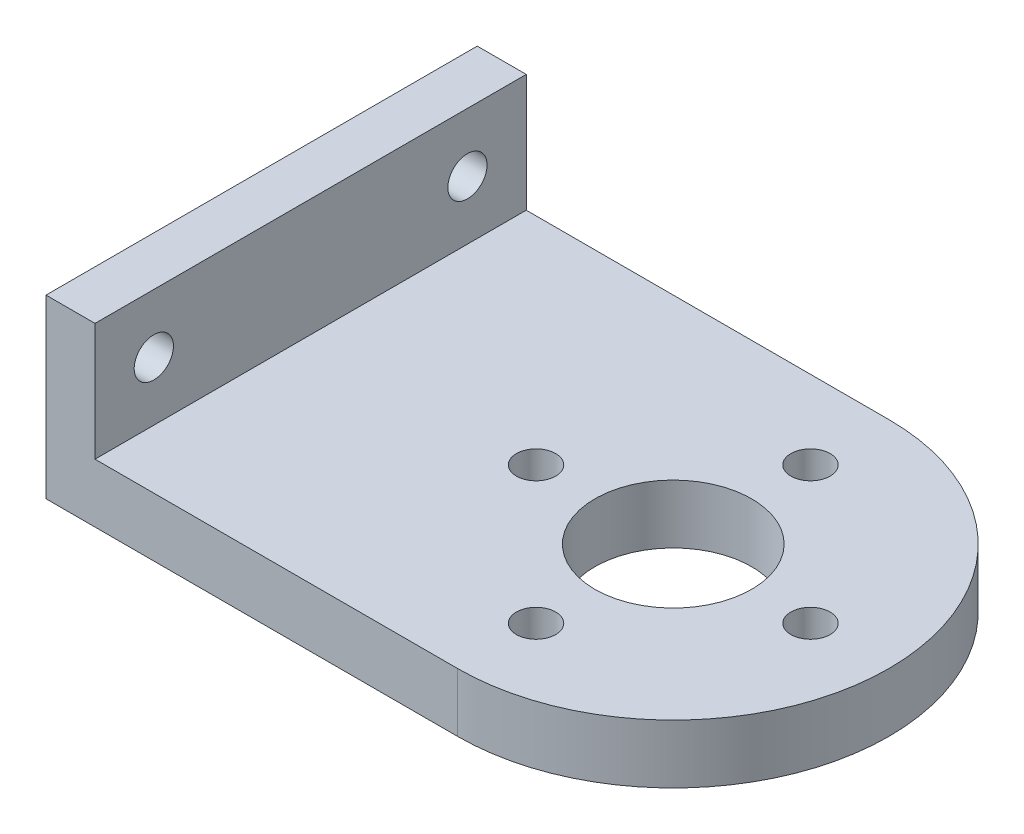
ISO-10303-21;
HEADER;
FILE_DESCRIPTION(('STEP AP214'),'2;1');
FILE_NAME('part.step','',(''),(''),'','','');
FILE_SCHEMA(('AUTOMOTIVE_DESIGN { 1 0 10303 214 1 1 1 1 }'));
ENDSEC;
DATA;
#1=APPLICATION_CONTEXT('core data for automotive mechanical design processes');
#2=APPLICATION_PROTOCOL_DEFINITION('international standard','automotive_design',2000,#1);
#3=PRODUCT_CONTEXT('',#1,'mechanical');
#4=PRODUCT('Part','Part','',(#3));
#5=PRODUCT_RELATED_PRODUCT_CATEGORY('part','',(#4));
#6=PRODUCT_DEFINITION_FORMATION('','',#4);
#7=PRODUCT_DEFINITION_CONTEXT('part definition',#1,'design');
#8=PRODUCT_DEFINITION('design','',#6,#7);
#9=PRODUCT_DEFINITION_SHAPE('','',#8);
#10=(LENGTH_UNIT() NAMED_UNIT(*) SI_UNIT(.MILLI.,.METRE.));
#11=(NAMED_UNIT(*) PLANE_ANGLE_UNIT() SI_UNIT($,.RADIAN.));
#12=(NAMED_UNIT(*) SI_UNIT($,.STERADIAN.) SOLID_ANGLE_UNIT());
#13=UNCERTAINTY_MEASURE_WITH_UNIT(LENGTH_MEASURE(1.E-05),#10,'distance_accuracy_value','');
#14=(GEOMETRIC_REPRESENTATION_CONTEXT(3) GLOBAL_UNCERTAINTY_ASSIGNED_CONTEXT((#13)) GLOBAL_UNIT_ASSIGNED_CONTEXT((#10,
#11,#12)) REPRESENTATION_CONTEXT('',''));
#15=CARTESIAN_POINT('',(0.,0.,0.));
#16=DIRECTION('',(0.,0.,1.));
#17=DIRECTION('',(1.,0.,0.));
#18=AXIS2_PLACEMENT_3D('',#15,#16,#17);
#19=CARTESIAN_POINT('',(-14.,3.,0.));
#20=DIRECTION('',(-1.,0.,0.));
#21=DIRECTION('',(0.,0.,1.));
#22=AXIS2_PLACEMENT_3D('',#19,#20,#21);
#23=PLANE('',#22);
#24=CARTESIAN_POINT('',(-14.,6.,8.));
#25=DIRECTION('',(-1.,0.,0.));
#26=DIRECTION('',(0.,0.,1.));
#27=AXIS2_PLACEMENT_3D('',#24,#25,#26);
#28=CIRCLE('',#27,1.);
#29=CARTESIAN_POINT('',(-14.,6.,9.));
#30=VERTEX_POINT('',#29);
#31=EDGE_CURVE('E172',#30,#30,#28,.T.);
#32=ORIENTED_EDGE('',*,*,#31,.F.);
#33=EDGE_LOOP('',(#32));
#34=FACE_BOUND('',#33,.T.);
#35=CARTESIAN_POINT('',(-14.,6.,-8.));
#36=DIRECTION('',(-1.,0.,0.));
#37=DIRECTION('',(0.,0.,1.));
#38=AXIS2_PLACEMENT_3D('',#35,#36,#37);
#39=CIRCLE('',#38,1.);
#40=CARTESIAN_POINT('',(-14.,6.,-7.));
#41=VERTEX_POINT('',#40);
#42=EDGE_CURVE('E158',#41,#41,#39,.T.);
#43=ORIENTED_EDGE('',*,*,#42,.F.);
#44=EDGE_LOOP('',(#43));
#45=FACE_BOUND('',#44,.T.);
#46=DIRECTION('',(0.,0.,-1.));
#47=VECTOR('',#46,1.);
#48=CARTESIAN_POINT('',(-14.,0.,0.));
#49=LINE('',#48,#47);
#50=CARTESIAN_POINT('',(-14.,0.,11.));
#51=VERTEX_POINT('',#50);
#52=CARTESIAN_POINT('',(-14.,0.,-11.));
#53=VERTEX_POINT('',#52);
#54=EDGE_CURVE('E83',#51,#53,#49,.T.);
#55=ORIENTED_EDGE('',*,*,#54,.F.);
#56=DIRECTION('',(0.,-1.,0.));
#57=VECTOR('',#56,1.);
#58=CARTESIAN_POINT('',(-14.,3.,11.));
#59=LINE('',#58,#57);
#60=CARTESIAN_POINT('',(-14.,9.,11.));
#61=VERTEX_POINT('',#60);
#62=EDGE_CURVE('E11',#61,#51,#59,.T.);
#63=ORIENTED_EDGE('',*,*,#62,.F.);
#64=DIRECTION('',(0.,0.,1.));
#65=VECTOR('',#64,1.);
#66=CARTESIAN_POINT('',(-14.,9.,11.));
#67=LINE('',#66,#65);
#68=CARTESIAN_POINT('',(-14.,9.,-11.));
#69=VERTEX_POINT('',#68);
#70=EDGE_CURVE('E86',#69,#61,#67,.T.);
#71=ORIENTED_EDGE('',*,*,#70,.F.);
#72=DIRECTION('',(0.,-1.,0.));
#73=VECTOR('',#72,1.);
#74=CARTESIAN_POINT('',(-14.,3.,-11.));
#75=LINE('',#74,#73);
#76=EDGE_CURVE('E80',#69,#53,#75,.T.);
#77=ORIENTED_EDGE('',*,*,#76,.T.);
#78=EDGE_LOOP('',(#55,#63,#71,#77));
#79=FACE_BOUND('',#78,.T.);
#80=ADVANCED_FACE('F38',(#34,#45,#79),#23,.T.);
#81=CARTESIAN_POINT('',(0.,3.,11.));
#82=DIRECTION('',(0.,0.,1.));
#83=DIRECTION('',(1.,0.,0.));
#84=AXIS2_PLACEMENT_3D('',#81,#82,#83);
#85=PLANE('',#84);
#86=DIRECTION('',(-1.,0.,0.));
#87=VECTOR('',#86,1.);
#88=CARTESIAN_POINT('',(0.,0.,11.));
#89=LINE('',#88,#87);
#90=CARTESIAN_POINT('',(7.,0.,11.));
#91=VERTEX_POINT('',#90);
#92=EDGE_CURVE('E100',#91,#51,#89,.T.);
#93=ORIENTED_EDGE('',*,*,#92,.F.);
#94=DIRECTION('',(0.,-1.,0.));
#95=VECTOR('',#94,1.);
#96=CARTESIAN_POINT('',(7.,3.,11.));
#97=LINE('',#96,#95);
#98=CARTESIAN_POINT('',(7.,3.,11.));
#99=VERTEX_POINT('',#98);
#100=EDGE_CURVE('E46',#99,#91,#97,.T.);
#101=ORIENTED_EDGE('',*,*,#100,.F.);
#102=DIRECTION('',(-1.,0.,0.));
#103=VECTOR('',#102,1.);
#104=CARTESIAN_POINT('',(0.,3.,11.));
#105=LINE('',#104,#103);
#106=CARTESIAN_POINT('',(-11.5,3.,11.));
#107=VERTEX_POINT('',#106);
#108=EDGE_CURVE('E139',#99,#107,#105,.T.);
#109=ORIENTED_EDGE('',*,*,#108,.T.);
#110=DIRECTION('',(0.,-1.,0.));
#111=VECTOR('',#110,1.);
#112=CARTESIAN_POINT('',(-11.5,9.,11.));
#113=LINE('',#112,#111);
#114=CARTESIAN_POINT('',(-11.5,9.,11.));
#115=VERTEX_POINT('',#114);
#116=EDGE_CURVE('E134',#115,#107,#113,.T.);
#117=ORIENTED_EDGE('',*,*,#116,.F.);
#118=DIRECTION('',(1.,0.,0.));
#119=VECTOR('',#118,1.);
#120=CARTESIAN_POINT('',(-11.5,9.,11.));
#121=LINE('',#120,#119);
#122=EDGE_CURVE('E163',#61,#115,#121,.T.);
#123=ORIENTED_EDGE('',*,*,#122,.F.);
#124=ORIENTED_EDGE('',*,*,#62,.T.);
#125=EDGE_LOOP('',(#93,#101,#109,#117,#123,#124));
#126=FACE_BOUND('',#125,.T.);
#127=ADVANCED_FACE('F120',(#126),#85,.T.);
#128=CARTESIAN_POINT('',(7.,3.,0.));
#129=DIRECTION('',(0.,-1.,0.));
#130=DIRECTION('',(0.,0.,-1.));
#131=AXIS2_PLACEMENT_3D('',#128,#129,#130);
#132=CYLINDRICAL_SURFACE('',#131,11.);
#133=CARTESIAN_POINT('',(7.,0.,0.));
#134=DIRECTION('',(0.,1.,0.));
#135=DIRECTION('',(0.,0.,1.));
#136=AXIS2_PLACEMENT_3D('',#133,#134,#135);
#137=CIRCLE('',#136,11.);
#138=CARTESIAN_POINT('',(7.,0.,-11.));
#139=VERTEX_POINT('',#138);
#140=EDGE_CURVE('E107',#91,#139,#137,.T.);
#141=ORIENTED_EDGE('',*,*,#140,.T.);
#142=DIRECTION('',(0.,-1.,0.));
#143=VECTOR('',#142,1.);
#144=CARTESIAN_POINT('',(7.,3.,-11.));
#145=LINE('',#144,#143);
#146=CARTESIAN_POINT('',(7.,3.,-11.));
#147=VERTEX_POINT('',#146);
#148=EDGE_CURVE('E90',#147,#139,#145,.T.);
#149=ORIENTED_EDGE('',*,*,#148,.F.);
#150=CARTESIAN_POINT('',(7.,3.,0.));
#151=DIRECTION('',(0.,1.,0.));
#152=DIRECTION('',(0.,0.,1.));
#153=AXIS2_PLACEMENT_3D('',#150,#151,#152);
#154=CIRCLE('',#153,11.);
#155=EDGE_CURVE('E118',#99,#147,#154,.T.);
#156=ORIENTED_EDGE('',*,*,#155,.F.);
#157=ORIENTED_EDGE('',*,*,#100,.T.);
#158=EDGE_LOOP('',(#141,#149,#156,#157));
#159=FACE_BOUND('',#158,.T.);
#160=ADVANCED_FACE('F117',(#159),#132,.T.);
#161=CARTESIAN_POINT('',(0.,3.,-11.));
#162=DIRECTION('',(0.,0.,-1.));
#163=DIRECTION('',(-1.,0.,0.));
#164=AXIS2_PLACEMENT_3D('',#161,#162,#163);
#165=PLANE('',#164);
#166=DIRECTION('',(1.,0.,0.));
#167=VECTOR('',#166,1.);
#168=CARTESIAN_POINT('',(0.,0.,-11.));
#169=LINE('',#168,#167);
#170=EDGE_CURVE('E98',#53,#139,#169,.T.);
#171=ORIENTED_EDGE('',*,*,#170,.F.);
#172=ORIENTED_EDGE('',*,*,#76,.F.);
#173=DIRECTION('',(-1.,0.,0.));
#174=VECTOR('',#173,1.);
#175=CARTESIAN_POINT('',(-14.,9.,-11.));
#176=LINE('',#175,#174);
#177=CARTESIAN_POINT('',(-11.5,9.,-11.));
#178=VERTEX_POINT('',#177);
#179=EDGE_CURVE('E156',#178,#69,#176,.T.);
#180=ORIENTED_EDGE('',*,*,#179,.F.);
#181=DIRECTION('',(0.,-1.,0.));
#182=VECTOR('',#181,1.);
#183=CARTESIAN_POINT('',(-11.5,9.,-11.));
#184=LINE('',#183,#182);
#185=CARTESIAN_POINT('',(-11.5,3.,-11.));
#186=VERTEX_POINT('',#185);
#187=EDGE_CURVE('E154',#178,#186,#184,.T.);
#188=ORIENTED_EDGE('',*,*,#187,.T.);
#189=DIRECTION('',(1.,0.,0.));
#190=VECTOR('',#189,1.);
#191=CARTESIAN_POINT('',(0.,3.,-11.));
#192=LINE('',#191,#190);
#193=EDGE_CURVE('E61',#186,#147,#192,.T.);
#194=ORIENTED_EDGE('',*,*,#193,.T.);
#195=ORIENTED_EDGE('',*,*,#148,.T.);
#196=EDGE_LOOP('',(#171,#172,#180,#188,#194,#195));
#197=FACE_BOUND('',#196,.T.);
#198=ADVANCED_FACE('F103',(#197),#165,.T.);
#199=CARTESIAN_POINT('',(7.00000000000007,3.,-7.));
#200=DIRECTION('',(0.,-1.,0.));
#201=DIRECTION('',(0.,0.,-1.));
#202=AXIS2_PLACEMENT_3D('',#199,#200,#201);
#203=CYLINDRICAL_SURFACE('',#202,1.);
#204=CARTESIAN_POINT('',(7.00000000000007,3.,-7.));
#205=DIRECTION('',(0.,1.,0.));
#206=DIRECTION('',(0.,0.,1.));
#207=AXIS2_PLACEMENT_3D('',#204,#205,#206);
#208=CIRCLE('',#207,1.);
#209=CARTESIAN_POINT('',(7.00000000000007,3.,-6.));
#210=VERTEX_POINT('',#209);
#211=EDGE_CURVE('E141',#210,#210,#208,.T.);
#212=ORIENTED_EDGE('',*,*,#211,.T.);
#213=EDGE_LOOP('',(#212));
#214=FACE_BOUND('',#213,.T.);
#215=CARTESIAN_POINT('',(7.00000000000007,0.,-7.));
#216=DIRECTION('',(0.,1.,0.));
#217=DIRECTION('',(0.,0.,1.));
#218=AXIS2_PLACEMENT_3D('',#215,#216,#217);
#219=CIRCLE('',#218,1.);
#220=CARTESIAN_POINT('',(7.00000000000007,0.,-6.));
#221=VERTEX_POINT('',#220);
#222=EDGE_CURVE('E101',#221,#221,#219,.T.);
#223=ORIENTED_EDGE('',*,*,#222,.F.);
#224=EDGE_LOOP('',(#223));
#225=FACE_BOUND('',#224,.T.);
#226=ADVANCED_FACE('F236',(#214,#225),#203,.F.);
#227=CARTESIAN_POINT('',(14.,3.,0.));
#228=DIRECTION('',(0.,-1.,0.));
#229=DIRECTION('',(0.,0.,-1.));
#230=AXIS2_PLACEMENT_3D('',#227,#228,#229);
#231=CYLINDRICAL_SURFACE('',#230,1.);
#232=CARTESIAN_POINT('',(14.,3.,0.));
#233=DIRECTION('',(0.,1.,0.));
#234=DIRECTION('',(0.,0.,1.));
#235=AXIS2_PLACEMENT_3D('',#232,#233,#234);
#236=CIRCLE('',#235,1.);
#237=CARTESIAN_POINT('',(14.,3.,1.));
#238=VERTEX_POINT('',#237);
#239=EDGE_CURVE('E144',#238,#238,#236,.T.);
#240=ORIENTED_EDGE('',*,*,#239,.T.);
#241=EDGE_LOOP('',(#240));
#242=FACE_BOUND('',#241,.T.);
#243=CARTESIAN_POINT('',(14.,0.,0.));
#244=DIRECTION('',(0.,1.,0.));
#245=DIRECTION('',(0.,0.,1.));
#246=AXIS2_PLACEMENT_3D('',#243,#244,#245);
#247=CIRCLE('',#246,1.);
#248=CARTESIAN_POINT('',(14.,0.,1.));
#249=VERTEX_POINT('',#248);
#250=EDGE_CURVE('E125',#249,#249,#247,.T.);
#251=ORIENTED_EDGE('',*,*,#250,.F.);
#252=EDGE_LOOP('',(#251));
#253=FACE_BOUND('',#252,.T.);
#254=ADVANCED_FACE('F239',(#242,#253),#231,.F.);
#255=CARTESIAN_POINT('',(7.,3.,0.));
#256=DIRECTION('',(0.,-1.,0.));
#257=DIRECTION('',(0.,0.,-1.));
#258=AXIS2_PLACEMENT_3D('',#255,#256,#257);
#259=CYLINDRICAL_SURFACE('',#258,4.);
#260=CARTESIAN_POINT('',(7.,3.,0.));
#261=DIRECTION('',(0.,1.,0.));
#262=DIRECTION('',(0.,0.,1.));
#263=AXIS2_PLACEMENT_3D('',#260,#261,#262);
#264=CIRCLE('',#263,4.);
#265=CARTESIAN_POINT('',(7.,3.,4.));
#266=VERTEX_POINT('',#265);
#267=EDGE_CURVE('E147',#266,#266,#264,.T.);
#268=ORIENTED_EDGE('',*,*,#267,.T.);
#269=EDGE_LOOP('',(#268));
#270=FACE_BOUND('',#269,.T.);
#271=CARTESIAN_POINT('',(7.,0.,0.));
#272=DIRECTION('',(0.,1.,0.));
#273=DIRECTION('',(0.,0.,1.));
#274=AXIS2_PLACEMENT_3D('',#271,#272,#273);
#275=CIRCLE('',#274,4.);
#276=CARTESIAN_POINT('',(7.,0.,4.));
#277=VERTEX_POINT('',#276);
#278=EDGE_CURVE('E128',#277,#277,#275,.T.);
#279=ORIENTED_EDGE('',*,*,#278,.F.);
#280=EDGE_LOOP('',(#279));
#281=FACE_BOUND('',#280,.T.);
#282=ADVANCED_FACE('F242',(#270,#281),#259,.F.);
#283=CARTESIAN_POINT('',(0.,3.,0.));
#284=DIRECTION('',(0.,-1.,0.));
#285=DIRECTION('',(0.,0.,-1.));
#286=AXIS2_PLACEMENT_3D('',#283,#284,#285);
#287=CYLINDRICAL_SURFACE('',#286,1.);
#288=CARTESIAN_POINT('',(0.,3.,0.));
#289=DIRECTION('',(0.,1.,0.));
#290=DIRECTION('',(0.,0.,1.));
#291=AXIS2_PLACEMENT_3D('',#288,#289,#290);
#292=CIRCLE('',#291,1.);
#293=CARTESIAN_POINT('',(0.,3.,1.00000000000005));
#294=VERTEX_POINT('',#293);
#295=EDGE_CURVE('E110',#294,#294,#292,.T.);
#296=ORIENTED_EDGE('',*,*,#295,.T.);
#297=EDGE_LOOP('',(#296));
#298=FACE_BOUND('',#297,.T.);
#299=CARTESIAN_POINT('',(0.,0.,0.));
#300=DIRECTION('',(0.,1.,0.));
#301=DIRECTION('',(0.,0.,1.));
#302=AXIS2_PLACEMENT_3D('',#299,#300,#301);
#303=CIRCLE('',#302,1.);
#304=CARTESIAN_POINT('',(0.,0.,1.00000000000005));
#305=VERTEX_POINT('',#304);
#306=EDGE_CURVE('E131',#305,#305,#303,.T.);
#307=ORIENTED_EDGE('',*,*,#306,.F.);
#308=EDGE_LOOP('',(#307));
#309=FACE_BOUND('',#308,.T.);
#310=ADVANCED_FACE('F40',(#298,#309),#287,.F.);
#311=CARTESIAN_POINT('',(6.99999999999998,3.,7.));
#312=DIRECTION('',(0.,-1.,0.));
#313=DIRECTION('',(0.,0.,-1.));
#314=AXIS2_PLACEMENT_3D('',#311,#312,#313);
#315=CYLINDRICAL_SURFACE('',#314,1.);
#316=CARTESIAN_POINT('',(6.99999999999998,3.,7.));
#317=DIRECTION('',(0.,1.,0.));
#318=DIRECTION('',(0.,0.,1.));
#319=AXIS2_PLACEMENT_3D('',#316,#317,#318);
#320=CIRCLE('',#319,1.);
#321=CARTESIAN_POINT('',(6.99999999999998,3.,8.));
#322=VERTEX_POINT('',#321);
#323=EDGE_CURVE('E91',#322,#322,#320,.T.);
#324=ORIENTED_EDGE('',*,*,#323,.T.);
#325=EDGE_LOOP('',(#324));
#326=FACE_BOUND('',#325,.T.);
#327=CARTESIAN_POINT('',(6.99999999999998,0.,7.));
#328=DIRECTION('',(0.,1.,0.));
#329=DIRECTION('',(0.,0.,1.));
#330=AXIS2_PLACEMENT_3D('',#327,#328,#329);
#331=CIRCLE('',#330,1.);
#332=CARTESIAN_POINT('',(6.99999999999998,0.,8.));
#333=VERTEX_POINT('',#332);
#334=EDGE_CURVE('E106',#333,#333,#331,.T.);
#335=ORIENTED_EDGE('',*,*,#334,.F.);
#336=EDGE_LOOP('',(#335));
#337=FACE_BOUND('',#336,.T.);
#338=ADVANCED_FACE('F203',(#326,#337),#315,.F.);
#339=CARTESIAN_POINT('',(0.,3.,0.));
#340=DIRECTION('',(0.,1.,0.));
#341=DIRECTION('',(0.,0.,1.));
#342=AXIS2_PLACEMENT_3D('',#339,#340,#341);
#343=PLANE('',#342);
#344=DIRECTION('',(0.,0.,-1.));
#345=VECTOR('',#344,1.);
#346=CARTESIAN_POINT('',(-11.5,3.,-11.));
#347=LINE('',#346,#345);
#348=EDGE_CURVE('E53',#107,#186,#347,.T.);
#349=ORIENTED_EDGE('',*,*,#348,.F.);
#350=ORIENTED_EDGE('',*,*,#108,.F.);
#351=ORIENTED_EDGE('',*,*,#155,.T.);
#352=ORIENTED_EDGE('',*,*,#193,.F.);
#353=EDGE_LOOP('',(#349,#350,#351,#352));
#354=FACE_BOUND('',#353,.T.);
#355=ORIENTED_EDGE('',*,*,#295,.F.);
#356=EDGE_LOOP('',(#355));
#357=FACE_BOUND('',#356,.T.);
#358=ORIENTED_EDGE('',*,*,#267,.F.);
#359=EDGE_LOOP('',(#358));
#360=FACE_BOUND('',#359,.T.);
#361=ORIENTED_EDGE('',*,*,#239,.F.);
#362=EDGE_LOOP('',(#361));
#363=FACE_BOUND('',#362,.T.);
#364=ORIENTED_EDGE('',*,*,#211,.F.);
#365=EDGE_LOOP('',(#364));
#366=FACE_BOUND('',#365,.T.);
#367=ORIENTED_EDGE('',*,*,#323,.F.);
#368=EDGE_LOOP('',(#367));
#369=FACE_BOUND('',#368,.T.);
#370=ADVANCED_FACE('F200',(#354,#357,#360,#363,#366,#369),#343,.T.);
#371=CARTESIAN_POINT('',(0.,0.,0.));
#372=DIRECTION('',(0.,1.,0.));
#373=DIRECTION('',(0.,0.,1.));
#374=AXIS2_PLACEMENT_3D('',#371,#372,#373);
#375=PLANE('',#374);
#376=ORIENTED_EDGE('',*,*,#306,.T.);
#377=EDGE_LOOP('',(#376));
#378=FACE_BOUND('',#377,.T.);
#379=ORIENTED_EDGE('',*,*,#278,.T.);
#380=EDGE_LOOP('',(#379));
#381=FACE_BOUND('',#380,.T.);
#382=ORIENTED_EDGE('',*,*,#250,.T.);
#383=EDGE_LOOP('',(#382));
#384=FACE_BOUND('',#383,.T.);
#385=ORIENTED_EDGE('',*,*,#222,.T.);
#386=EDGE_LOOP('',(#385));
#387=FACE_BOUND('',#386,.T.);
#388=ORIENTED_EDGE('',*,*,#54,.T.);
#389=ORIENTED_EDGE('',*,*,#170,.T.);
#390=ORIENTED_EDGE('',*,*,#140,.F.);
#391=ORIENTED_EDGE('',*,*,#92,.T.);
#392=EDGE_LOOP('',(#388,#389,#390,#391));
#393=FACE_BOUND('',#392,.T.);
#394=ORIENTED_EDGE('',*,*,#334,.T.);
#395=EDGE_LOOP('',(#394));
#396=FACE_BOUND('',#395,.T.);
#397=ADVANCED_FACE('F95',(#378,#381,#384,#387,#393,#396),#375,.F.);
#398=CARTESIAN_POINT('',(-11.5,9.,-11.));
#399=DIRECTION('',(-1.,0.,0.));
#400=DIRECTION('',(0.,0.,1.));
#401=AXIS2_PLACEMENT_3D('',#398,#399,#400);
#402=PLANE('',#401);
#403=CARTESIAN_POINT('',(-11.5,6.,8.));
#404=DIRECTION('',(1.,0.,0.));
#405=DIRECTION('',(0.,0.,-1.));
#406=AXIS2_PLACEMENT_3D('',#403,#404,#405);
#407=CIRCLE('',#406,1.);
#408=CARTESIAN_POINT('',(-11.5,6.,7.));
#409=VERTEX_POINT('',#408);
#410=EDGE_CURVE('E175',#409,#409,#407,.T.);
#411=ORIENTED_EDGE('',*,*,#410,.F.);
#412=EDGE_LOOP('',(#411));
#413=FACE_BOUND('',#412,.T.);
#414=CARTESIAN_POINT('',(-11.5,6.,-8.));
#415=DIRECTION('',(1.,0.,0.));
#416=DIRECTION('',(0.,0.,-1.));
#417=AXIS2_PLACEMENT_3D('',#414,#415,#416);
#418=CIRCLE('',#417,1.);
#419=CARTESIAN_POINT('',(-11.5,6.,-9.));
#420=VERTEX_POINT('',#419);
#421=EDGE_CURVE('E169',#420,#420,#418,.T.);
#422=ORIENTED_EDGE('',*,*,#421,.F.);
#423=EDGE_LOOP('',(#422));
#424=FACE_BOUND('',#423,.T.);
#425=ORIENTED_EDGE('',*,*,#348,.T.);
#426=ORIENTED_EDGE('',*,*,#187,.F.);
#427=DIRECTION('',(0.,0.,-1.));
#428=VECTOR('',#427,1.);
#429=CARTESIAN_POINT('',(-11.5,9.,-11.));
#430=LINE('',#429,#428);
#431=EDGE_CURVE('E160',#115,#178,#430,.T.);
#432=ORIENTED_EDGE('',*,*,#431,.F.);
#433=ORIENTED_EDGE('',*,*,#116,.T.);
#434=EDGE_LOOP('',(#425,#426,#432,#433));
#435=FACE_BOUND('',#434,.T.);
#436=ADVANCED_FACE('F181',(#413,#424,#435),#402,.F.);
#437=CARTESIAN_POINT('',(0.,9.,0.));
#438=DIRECTION('',(0.,-1.,0.));
#439=DIRECTION('',(0.,0.,-1.));
#440=AXIS2_PLACEMENT_3D('',#437,#438,#439);
#441=PLANE('',#440);
#442=ORIENTED_EDGE('',*,*,#70,.T.);
#443=ORIENTED_EDGE('',*,*,#122,.T.);
#444=ORIENTED_EDGE('',*,*,#431,.T.);
#445=ORIENTED_EDGE('',*,*,#179,.T.);
#446=EDGE_LOOP('',(#442,#443,#444,#445));
#447=FACE_BOUND('',#446,.T.);
#448=ADVANCED_FACE('F184',(#447),#441,.F.);
#449=CARTESIAN_POINT('',(-17.5,6.,-8.));
#450=DIRECTION('',(1.,0.,0.));
#451=DIRECTION('',(0.,0.,-1.));
#452=AXIS2_PLACEMENT_3D('',#449,#450,#451);
#453=CYLINDRICAL_SURFACE('',#452,1.);
#454=ORIENTED_EDGE('',*,*,#42,.T.);
#455=EDGE_LOOP('',(#454));
#456=FACE_BOUND('',#455,.T.);
#457=ORIENTED_EDGE('',*,*,#421,.T.);
#458=EDGE_LOOP('',(#457));
#459=FACE_BOUND('',#458,.T.);
#460=ADVANCED_FACE('F285',(#456,#459),#453,.F.);
#461=CARTESIAN_POINT('',(-17.5,6.,8.));
#462=DIRECTION('',(1.,0.,0.));
#463=DIRECTION('',(0.,0.,-1.));
#464=AXIS2_PLACEMENT_3D('',#461,#462,#463);
#465=CYLINDRICAL_SURFACE('',#464,1.);
#466=ORIENTED_EDGE('',*,*,#31,.T.);
#467=EDGE_LOOP('',(#466));
#468=FACE_BOUND('',#467,.T.);
#469=ORIENTED_EDGE('',*,*,#410,.T.);
#470=EDGE_LOOP('',(#469));
#471=FACE_BOUND('',#470,.T.);
#472=ADVANCED_FACE('F179',(#468,#471),#465,.F.);
#473=CLOSED_SHELL('',(#80,#127,#160,#198,#226,#254,#282,#310,#338,#370,#397,#436,#448,#460,#472));
#474=MANIFOLD_SOLID_BREP('B2',#473);
#475=ADVANCED_BREP_SHAPE_REPRESENTATION('',(#18,#474),#14);
#476=SHAPE_DEFINITION_REPRESENTATION(#9,#475);
ENDSEC;
END-ISO-10303-21;
